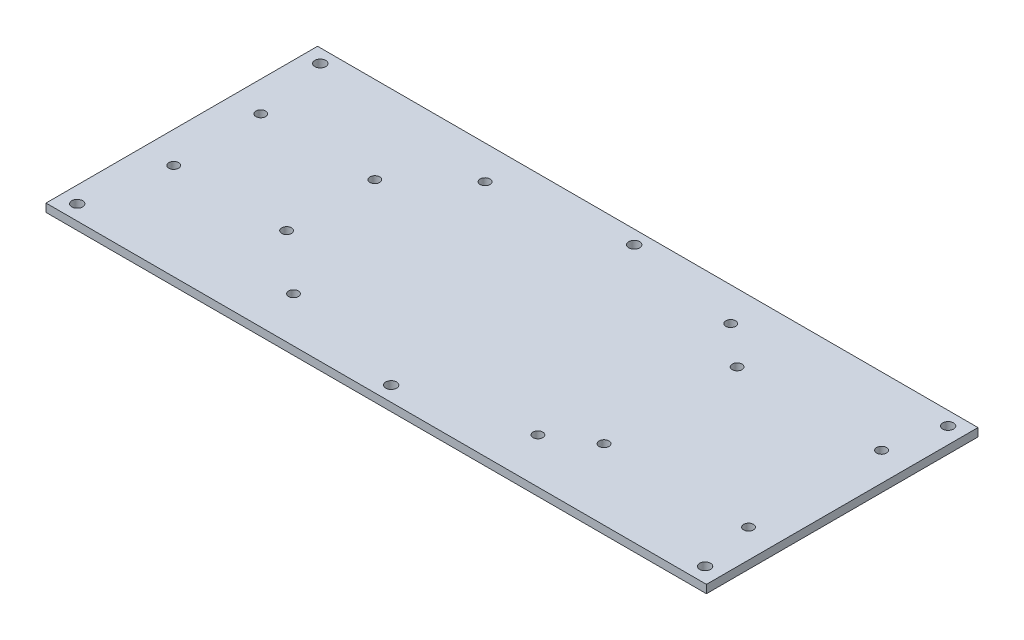
ISO-10303-21;
HEADER;
FILE_DESCRIPTION(('STEP AP214'),'2;1');
FILE_NAME('part.step','',(''),(''),'','','');
FILE_SCHEMA(('AUTOMOTIVE_DESIGN { 1 0 10303 214 1 1 1 1 }'));
ENDSEC;
DATA;
#1=APPLICATION_CONTEXT('core data for automotive mechanical design processes');
#2=APPLICATION_PROTOCOL_DEFINITION('international standard','automotive_design',2000,#1);
#3=PRODUCT_CONTEXT('',#1,'mechanical');
#4=PRODUCT('Part','Part','',(#3));
#5=PRODUCT_RELATED_PRODUCT_CATEGORY('part','',(#4));
#6=PRODUCT_DEFINITION_FORMATION('','',#4);
#7=PRODUCT_DEFINITION_CONTEXT('part definition',#1,'design');
#8=PRODUCT_DEFINITION('design','',#6,#7);
#9=PRODUCT_DEFINITION_SHAPE('','',#8);
#10=(LENGTH_UNIT() NAMED_UNIT(*) SI_UNIT(.MILLI.,.METRE.));
#11=(NAMED_UNIT(*) PLANE_ANGLE_UNIT() SI_UNIT($,.RADIAN.));
#12=(NAMED_UNIT(*) SI_UNIT($,.STERADIAN.) SOLID_ANGLE_UNIT());
#13=UNCERTAINTY_MEASURE_WITH_UNIT(LENGTH_MEASURE(1.E-05),#10,'distance_accuracy_value','');
#14=(GEOMETRIC_REPRESENTATION_CONTEXT(3) GLOBAL_UNCERTAINTY_ASSIGNED_CONTEXT((#13)) GLOBAL_UNIT_ASSIGNED_CONTEXT((#10,
#11,#12)) REPRESENTATION_CONTEXT('',''));
#15=CARTESIAN_POINT('',(0.,0.,0.));
#16=DIRECTION('',(0.,0.,1.));
#17=DIRECTION('',(1.,0.,0.));
#18=AXIS2_PLACEMENT_3D('',#15,#16,#17);
#19=CARTESIAN_POINT('',(0.,3.,0.));
#20=DIRECTION('',(0.,1.,0.));
#21=DIRECTION('',(0.,0.,1.));
#22=AXIS2_PLACEMENT_3D('',#19,#20,#21);
#23=PLANE('',#22);
#24=CARTESIAN_POINT('',(5.,3.,5.));
#25=DIRECTION('',(0.,1.,0.));
#26=DIRECTION('',(0.,0.,1.));
#27=AXIS2_PLACEMENT_3D('',#24,#25,#26);
#28=CIRCLE('',#27,2.);
#29=CARTESIAN_POINT('',(5.,3.,7.));
#30=VERTEX_POINT('',#29);
#31=EDGE_CURVE('E209',#30,#30,#28,.T.);
#32=ORIENTED_EDGE('',*,*,#31,.F.);
#33=EDGE_LOOP('',(#32));
#34=FACE_BOUND('',#33,.T.);
#35=CARTESIAN_POINT('',(178.495550597673,3.,25.));
#36=DIRECTION('',(0.,1.,0.));
#37=DIRECTION('',(0.,0.,1.));
#38=AXIS2_PLACEMENT_3D('',#35,#36,#37);
#39=CIRCLE('',#38,1.80000000000001);
#40=CARTESIAN_POINT('',(178.495550597673,3.,26.8));
#41=VERTEX_POINT('',#40);
#42=EDGE_CURVE('E197',#41,#41,#39,.T.);
#43=ORIENTED_EDGE('',*,*,#42,.F.);
#44=EDGE_LOOP('',(#43));
#45=FACE_BOUND('',#44,.T.);
#46=CARTESIAN_POINT('',(178.495550597673,3.,74.));
#47=DIRECTION('',(0.,1.,0.));
#48=DIRECTION('',(0.,0.,1.));
#49=AXIS2_PLACEMENT_3D('',#46,#47,#48);
#50=CIRCLE('',#49,1.80000000000001);
#51=CARTESIAN_POINT('',(178.495550597673,3.,75.8));
#52=VERTEX_POINT('',#51);
#53=EDGE_CURVE('E185',#52,#52,#50,.T.);
#54=ORIENTED_EDGE('',*,*,#53,.F.);
#55=EDGE_LOOP('',(#54));
#56=FACE_BOUND('',#55,.T.);
#57=CARTESIAN_POINT('',(231.695550597673,3.,25.));
#58=DIRECTION('',(0.,1.,0.));
#59=DIRECTION('',(0.,0.,1.));
#60=AXIS2_PLACEMENT_3D('',#57,#58,#59);
#61=CIRCLE('',#60,1.80000000000001);
#62=CARTESIAN_POINT('',(231.695550597673,3.,26.8));
#63=VERTEX_POINT('',#62);
#64=EDGE_CURVE('E173',#63,#63,#61,.T.);
#65=ORIENTED_EDGE('',*,*,#64,.F.);
#66=EDGE_LOOP('',(#65));
#67=FACE_BOUND('',#66,.T.);
#68=CARTESIAN_POINT('',(52.0911869267946,3.,32.));
#69=DIRECTION('',(0.,1.,0.));
#70=DIRECTION('',(0.,0.,1.));
#71=AXIS2_PLACEMENT_3D('',#68,#69,#70);
#72=CIRCLE('',#71,1.79999999999999);
#73=CARTESIAN_POINT('',(52.0911869267946,3.,33.8));
#74=VERTEX_POINT('',#73);
#75=EDGE_CURVE('E161',#74,#74,#72,.T.);
#76=ORIENTED_EDGE('',*,*,#75,.F.);
#77=EDGE_LOOP('',(#76));
#78=FACE_BOUND('',#77,.T.);
#79=CARTESIAN_POINT('',(10.0911869267946,3.,32.));
#80=DIRECTION('',(0.,1.,0.));
#81=DIRECTION('',(0.,0.,1.));
#82=AXIS2_PLACEMENT_3D('',#79,#80,#81);
#83=CIRCLE('',#82,1.80000000000001);
#84=CARTESIAN_POINT('',(10.0911869267946,3.,33.8));
#85=VERTEX_POINT('',#84);
#86=EDGE_CURVE('E149',#85,#85,#83,.T.);
#87=ORIENTED_EDGE('',*,*,#86,.F.);
#88=EDGE_LOOP('',(#87));
#89=FACE_BOUND('',#88,.T.);
#90=CARTESIAN_POINT('',(163.495550597673,3.,83.3605255005435));
#91=DIRECTION('',(0.,1.,0.));
#92=DIRECTION('',(0.,0.,1.));
#93=AXIS2_PLACEMENT_3D('',#90,#91,#92);
#94=CIRCLE('',#93,1.80000000000001);
#95=CARTESIAN_POINT('',(163.495550597673,3.,85.1605255005435));
#96=VERTEX_POINT('',#95);
#97=EDGE_CURVE('E137',#96,#96,#94,.T.);
#98=ORIENTED_EDGE('',*,*,#97,.F.);
#99=EDGE_LOOP('',(#98));
#100=FACE_BOUND('',#99,.T.);
#101=CARTESIAN_POINT('',(73.4955505976732,3.,83.3605255005436));
#102=DIRECTION('',(0.,1.,0.));
#103=DIRECTION('',(0.,0.,1.));
#104=AXIS2_PLACEMENT_3D('',#101,#102,#103);
#105=CIRCLE('',#104,1.79999999999999);
#106=CARTESIAN_POINT('',(73.4955505976732,3.,85.1605255005436));
#107=VERTEX_POINT('',#106);
#108=EDGE_CURVE('E125',#107,#107,#105,.T.);
#109=ORIENTED_EDGE('',*,*,#108,.F.);
#110=EDGE_LOOP('',(#109));
#111=FACE_BOUND('',#110,.T.);
#112=CARTESIAN_POINT('',(73.0495761534593,3.,12.3619261707321));
#113=DIRECTION('',(0.,1.,0.));
#114=DIRECTION('',(0.,0.,1.));
#115=AXIS2_PLACEMENT_3D('',#112,#113,#114);
#116=CIRCLE('',#115,1.79999999999999);
#117=CARTESIAN_POINT('',(73.0495761534593,3.,14.1619261707321));
#118=VERTEX_POINT('',#117);
#119=EDGE_CURVE('E104',#118,#118,#116,.T.);
#120=ORIENTED_EDGE('',*,*,#119,.F.);
#121=EDGE_LOOP('',(#120));
#122=FACE_BOUND('',#121,.T.);
#123=DIRECTION('',(0.,0.,1.));
#124=VECTOR('',#123,1.);
#125=CARTESIAN_POINT('',(-1.,3.,0.));
#126=LINE('',#125,#124);
#127=CARTESIAN_POINT('',(-1.,3.,0.));
#128=VERTEX_POINT('',#127);
#129=CARTESIAN_POINT('',(-1.,3.,100.));
#130=VERTEX_POINT('',#129);
#131=EDGE_CURVE('E89',#128,#130,#126,.T.);
#132=ORIENTED_EDGE('',*,*,#131,.T.);
#133=DIRECTION('',(1.,0.,0.));
#134=VECTOR('',#133,1.);
#135=CARTESIAN_POINT('',(-1.,3.,100.));
#136=LINE('',#135,#134);
#137=CARTESIAN_POINT('',(242.2,3.,100.));
#138=VERTEX_POINT('',#137);
#139=EDGE_CURVE('E84',#130,#138,#136,.T.);
#140=ORIENTED_EDGE('',*,*,#139,.T.);
#141=DIRECTION('',(0.,0.,-1.));
#142=VECTOR('',#141,1.);
#143=CARTESIAN_POINT('',(242.2,3.,0.));
#144=LINE('',#143,#142);
#145=CARTESIAN_POINT('',(242.2,3.,0.));
#146=VERTEX_POINT('',#145);
#147=EDGE_CURVE('E87',#138,#146,#144,.T.);
#148=ORIENTED_EDGE('',*,*,#147,.T.);
#149=DIRECTION('',(-1.,0.,0.));
#150=VECTOR('',#149,1.);
#151=CARTESIAN_POINT('',(-1.,3.,0.));
#152=LINE('',#151,#150);
#153=EDGE_CURVE('E54',#146,#128,#152,.T.);
#154=ORIENTED_EDGE('',*,*,#153,.T.);
#155=EDGE_LOOP('',(#132,#140,#148,#154));
#156=FACE_BOUND('',#155,.T.);
#157=CARTESIAN_POINT('',(236.2,3.,5.));
#158=DIRECTION('',(0.,1.,0.));
#159=DIRECTION('',(0.,0.,1.));
#160=AXIS2_PLACEMENT_3D('',#157,#158,#159);
#161=CIRCLE('',#160,2.);
#162=CARTESIAN_POINT('',(236.2,3.,7.));
#163=VERTEX_POINT('',#162);
#164=EDGE_CURVE('E119',#163,#163,#161,.T.);
#165=ORIENTED_EDGE('',*,*,#164,.F.);
#166=EDGE_LOOP('',(#165));
#167=FACE_BOUND('',#166,.T.);
#168=CARTESIAN_POINT('',(163.495550597673,3.,12.3605255005435));
#169=DIRECTION('',(0.,1.,0.));
#170=DIRECTION('',(0.,0.,1.));
#171=AXIS2_PLACEMENT_3D('',#168,#169,#170);
#172=CIRCLE('',#171,1.80000000000001);
#173=CARTESIAN_POINT('',(163.495550597673,3.,14.1605255005435));
#174=VERTEX_POINT('',#173);
#175=EDGE_CURVE('E131',#174,#174,#172,.T.);
#176=ORIENTED_EDGE('',*,*,#175,.F.);
#177=EDGE_LOOP('',(#176));
#178=FACE_BOUND('',#177,.T.);
#179=CARTESIAN_POINT('',(236.2,3.,94.5));
#180=DIRECTION('',(0.,1.,0.));
#181=DIRECTION('',(0.,0.,1.));
#182=AXIS2_PLACEMENT_3D('',#179,#180,#181);
#183=CIRCLE('',#182,2.);
#184=CARTESIAN_POINT('',(236.2,3.,96.5));
#185=VERTEX_POINT('',#184);
#186=EDGE_CURVE('E143',#185,#185,#183,.T.);
#187=ORIENTED_EDGE('',*,*,#186,.F.);
#188=EDGE_LOOP('',(#187));
#189=FACE_BOUND('',#188,.T.);
#190=CARTESIAN_POINT('',(10.5228834773099,3.,64.4971327671884));
#191=DIRECTION('',(0.,1.,0.));
#192=DIRECTION('',(0.,0.,1.));
#193=AXIS2_PLACEMENT_3D('',#190,#191,#192);
#194=CIRCLE('',#193,1.8);
#195=CARTESIAN_POINT('',(10.5228834773099,3.,66.2971327671885));
#196=VERTEX_POINT('',#195);
#197=EDGE_CURVE('E155',#196,#196,#194,.T.);
#198=ORIENTED_EDGE('',*,*,#197,.F.);
#199=EDGE_LOOP('',(#198));
#200=FACE_BOUND('',#199,.T.);
#201=CARTESIAN_POINT('',(52.0911869267946,3.,64.4971327671884));
#202=DIRECTION('',(0.,1.,0.));
#203=DIRECTION('',(0.,0.,1.));
#204=AXIS2_PLACEMENT_3D('',#201,#202,#203);
#205=CIRCLE('',#204,1.79999999999999);
#206=CARTESIAN_POINT('',(52.0911869267946,3.,66.2971327671884));
#207=VERTEX_POINT('',#206);
#208=EDGE_CURVE('E167',#207,#207,#205,.T.);
#209=ORIENTED_EDGE('',*,*,#208,.F.);
#210=EDGE_LOOP('',(#209));
#211=FACE_BOUND('',#210,.T.);
#212=CARTESIAN_POINT('',(231.695550597673,3.,74.));
#213=DIRECTION('',(0.,1.,0.));
#214=DIRECTION('',(0.,0.,1.));
#215=AXIS2_PLACEMENT_3D('',#212,#213,#214);
#216=CIRCLE('',#215,1.80000000000001);
#217=CARTESIAN_POINT('',(231.695550597673,3.,75.8));
#218=VERTEX_POINT('',#217);
#219=EDGE_CURVE('E179',#218,#218,#216,.T.);
#220=ORIENTED_EDGE('',*,*,#219,.F.);
#221=EDGE_LOOP('',(#220));
#222=FACE_BOUND('',#221,.T.);
#223=CARTESIAN_POINT('',(120.6,3.,5.00000000000001));
#224=DIRECTION('',(0.,1.,0.));
#225=DIRECTION('',(0.,0.,1.));
#226=AXIS2_PLACEMENT_3D('',#223,#224,#225);
#227=CIRCLE('',#226,2.);
#228=CARTESIAN_POINT('',(120.6,3.,7.));
#229=VERTEX_POINT('',#228);
#230=EDGE_CURVE('E191',#229,#229,#227,.T.);
#231=ORIENTED_EDGE('',*,*,#230,.F.);
#232=EDGE_LOOP('',(#231));
#233=FACE_BOUND('',#232,.T.);
#234=CARTESIAN_POINT('',(120.6,3.,94.5));
#235=DIRECTION('',(0.,1.,0.));
#236=DIRECTION('',(0.,0.,1.));
#237=AXIS2_PLACEMENT_3D('',#234,#235,#236);
#238=CIRCLE('',#237,2.);
#239=CARTESIAN_POINT('',(120.6,3.,96.5));
#240=VERTEX_POINT('',#239);
#241=EDGE_CURVE('E203',#240,#240,#238,.T.);
#242=ORIENTED_EDGE('',*,*,#241,.F.);
#243=EDGE_LOOP('',(#242));
#244=FACE_BOUND('',#243,.T.);
#245=CARTESIAN_POINT('',(4.99999999999999,3.,94.5));
#246=DIRECTION('',(0.,1.,0.));
#247=DIRECTION('',(0.,0.,1.));
#248=AXIS2_PLACEMENT_3D('',#245,#246,#247);
#249=CIRCLE('',#248,2.);
#250=CARTESIAN_POINT('',(4.99999999999999,3.,96.5));
#251=VERTEX_POINT('',#250);
#252=EDGE_CURVE('E215',#251,#251,#249,.T.);
#253=ORIENTED_EDGE('',*,*,#252,.F.);
#254=EDGE_LOOP('',(#253));
#255=FACE_BOUND('',#254,.T.);
#256=ADVANCED_FACE('F37',(#34,#45,#56,#67,#78,#89,#100,#111,#122,#156,#167,#178,#189,#200,#211,
#222,#233,#244,#255),#23,.T.);
#257=CARTESIAN_POINT('',(0.,0.,0.));
#258=DIRECTION('',(0.,1.,0.));
#259=DIRECTION('',(0.,0.,1.));
#260=AXIS2_PLACEMENT_3D('',#257,#258,#259);
#261=PLANE('',#260);
#262=DIRECTION('',(0.,0.,1.));
#263=VECTOR('',#262,1.);
#264=CARTESIAN_POINT('',(-1.,0.,0.));
#265=LINE('',#264,#263);
#266=CARTESIAN_POINT('',(-1.,0.,0.));
#267=VERTEX_POINT('',#266);
#268=CARTESIAN_POINT('',(-1.,0.,100.));
#269=VERTEX_POINT('',#268);
#270=EDGE_CURVE('E101',#267,#269,#265,.T.);
#271=ORIENTED_EDGE('',*,*,#270,.F.);
#272=DIRECTION('',(-1.,0.,0.));
#273=VECTOR('',#272,1.);
#274=CARTESIAN_POINT('',(-1.,0.,0.));
#275=LINE('',#274,#273);
#276=CARTESIAN_POINT('',(242.2,0.,0.));
#277=VERTEX_POINT('',#276);
#278=EDGE_CURVE('E77',#277,#267,#275,.T.);
#279=ORIENTED_EDGE('',*,*,#278,.F.);
#280=DIRECTION('',(0.,0.,-1.));
#281=VECTOR('',#280,1.);
#282=CARTESIAN_POINT('',(242.2,0.,0.));
#283=LINE('',#282,#281);
#284=CARTESIAN_POINT('',(242.2,0.,100.));
#285=VERTEX_POINT('',#284);
#286=EDGE_CURVE('E71',#285,#277,#283,.T.);
#287=ORIENTED_EDGE('',*,*,#286,.F.);
#288=DIRECTION('',(1.,0.,0.));
#289=VECTOR('',#288,1.);
#290=CARTESIAN_POINT('',(-1.,0.,100.));
#291=LINE('',#290,#289);
#292=EDGE_CURVE('E93',#269,#285,#291,.T.);
#293=ORIENTED_EDGE('',*,*,#292,.F.);
#294=EDGE_LOOP('',(#271,#279,#287,#293));
#295=FACE_BOUND('',#294,.T.);
#296=CARTESIAN_POINT('',(73.0495761534593,0.,12.3619261707321));
#297=DIRECTION('',(0.,1.,0.));
#298=DIRECTION('',(0.,0.,1.));
#299=AXIS2_PLACEMENT_3D('',#296,#297,#298);
#300=CIRCLE('',#299,1.79999999999999);
#301=CARTESIAN_POINT('',(73.0495761534593,0.,14.1619261707321));
#302=VERTEX_POINT('',#301);
#303=EDGE_CURVE('E116',#302,#302,#300,.T.);
#304=ORIENTED_EDGE('',*,*,#303,.T.);
#305=EDGE_LOOP('',(#304));
#306=FACE_BOUND('',#305,.T.);
#307=CARTESIAN_POINT('',(236.2,0.,5.));
#308=DIRECTION('',(0.,1.,0.));
#309=DIRECTION('',(0.,0.,1.));
#310=AXIS2_PLACEMENT_3D('',#307,#308,#309);
#311=CIRCLE('',#310,2.);
#312=CARTESIAN_POINT('',(236.2,0.,7.));
#313=VERTEX_POINT('',#312);
#314=EDGE_CURVE('E122',#313,#313,#311,.T.);
#315=ORIENTED_EDGE('',*,*,#314,.T.);
#316=EDGE_LOOP('',(#315));
#317=FACE_BOUND('',#316,.T.);
#318=CARTESIAN_POINT('',(73.4955505976732,0.,83.3605255005436));
#319=DIRECTION('',(0.,1.,0.));
#320=DIRECTION('',(0.,0.,1.));
#321=AXIS2_PLACEMENT_3D('',#318,#319,#320);
#322=CIRCLE('',#321,1.79999999999999);
#323=CARTESIAN_POINT('',(73.4955505976732,0.,85.1605255005436));
#324=VERTEX_POINT('',#323);
#325=EDGE_CURVE('E128',#324,#324,#322,.T.);
#326=ORIENTED_EDGE('',*,*,#325,.T.);
#327=EDGE_LOOP('',(#326));
#328=FACE_BOUND('',#327,.T.);
#329=CARTESIAN_POINT('',(163.495550597673,0.,12.3605255005435));
#330=DIRECTION('',(0.,1.,0.));
#331=DIRECTION('',(0.,0.,1.));
#332=AXIS2_PLACEMENT_3D('',#329,#330,#331);
#333=CIRCLE('',#332,1.80000000000001);
#334=CARTESIAN_POINT('',(163.495550597673,0.,14.1605255005435));
#335=VERTEX_POINT('',#334);
#336=EDGE_CURVE('E134',#335,#335,#333,.T.);
#337=ORIENTED_EDGE('',*,*,#336,.T.);
#338=EDGE_LOOP('',(#337));
#339=FACE_BOUND('',#338,.T.);
#340=CARTESIAN_POINT('',(163.495550597673,0.,83.3605255005435));
#341=DIRECTION('',(0.,1.,0.));
#342=DIRECTION('',(0.,0.,1.));
#343=AXIS2_PLACEMENT_3D('',#340,#341,#342);
#344=CIRCLE('',#343,1.80000000000001);
#345=CARTESIAN_POINT('',(163.495550597673,0.,85.1605255005435));
#346=VERTEX_POINT('',#345);
#347=EDGE_CURVE('E140',#346,#346,#344,.T.);
#348=ORIENTED_EDGE('',*,*,#347,.T.);
#349=EDGE_LOOP('',(#348));
#350=FACE_BOUND('',#349,.T.);
#351=CARTESIAN_POINT('',(236.2,0.,94.5));
#352=DIRECTION('',(0.,1.,0.));
#353=DIRECTION('',(0.,0.,1.));
#354=AXIS2_PLACEMENT_3D('',#351,#352,#353);
#355=CIRCLE('',#354,2.);
#356=CARTESIAN_POINT('',(236.2,0.,96.5));
#357=VERTEX_POINT('',#356);
#358=EDGE_CURVE('E146',#357,#357,#355,.T.);
#359=ORIENTED_EDGE('',*,*,#358,.T.);
#360=EDGE_LOOP('',(#359));
#361=FACE_BOUND('',#360,.T.);
#362=CARTESIAN_POINT('',(10.0911869267946,0.,32.));
#363=DIRECTION('',(0.,1.,0.));
#364=DIRECTION('',(0.,0.,1.));
#365=AXIS2_PLACEMENT_3D('',#362,#363,#364);
#366=CIRCLE('',#365,1.80000000000001);
#367=CARTESIAN_POINT('',(10.0911869267946,0.,33.8));
#368=VERTEX_POINT('',#367);
#369=EDGE_CURVE('E152',#368,#368,#366,.T.);
#370=ORIENTED_EDGE('',*,*,#369,.T.);
#371=EDGE_LOOP('',(#370));
#372=FACE_BOUND('',#371,.T.);
#373=CARTESIAN_POINT('',(10.5228834773099,0.,64.4971327671884));
#374=DIRECTION('',(0.,1.,0.));
#375=DIRECTION('',(0.,0.,1.));
#376=AXIS2_PLACEMENT_3D('',#373,#374,#375);
#377=CIRCLE('',#376,1.8);
#378=CARTESIAN_POINT('',(10.5228834773099,0.,66.2971327671885));
#379=VERTEX_POINT('',#378);
#380=EDGE_CURVE('E158',#379,#379,#377,.T.);
#381=ORIENTED_EDGE('',*,*,#380,.T.);
#382=EDGE_LOOP('',(#381));
#383=FACE_BOUND('',#382,.T.);
#384=CARTESIAN_POINT('',(52.0911869267946,0.,32.));
#385=DIRECTION('',(0.,1.,0.));
#386=DIRECTION('',(0.,0.,1.));
#387=AXIS2_PLACEMENT_3D('',#384,#385,#386);
#388=CIRCLE('',#387,1.79999999999999);
#389=CARTESIAN_POINT('',(52.0911869267946,0.,33.8));
#390=VERTEX_POINT('',#389);
#391=EDGE_CURVE('E164',#390,#390,#388,.T.);
#392=ORIENTED_EDGE('',*,*,#391,.T.);
#393=EDGE_LOOP('',(#392));
#394=FACE_BOUND('',#393,.T.);
#395=CARTESIAN_POINT('',(52.0911869267946,0.,64.4971327671884));
#396=DIRECTION('',(0.,1.,0.));
#397=DIRECTION('',(0.,0.,1.));
#398=AXIS2_PLACEMENT_3D('',#395,#396,#397);
#399=CIRCLE('',#398,1.79999999999999);
#400=CARTESIAN_POINT('',(52.0911869267946,0.,66.2971327671884));
#401=VERTEX_POINT('',#400);
#402=EDGE_CURVE('E170',#401,#401,#399,.T.);
#403=ORIENTED_EDGE('',*,*,#402,.T.);
#404=EDGE_LOOP('',(#403));
#405=FACE_BOUND('',#404,.T.);
#406=CARTESIAN_POINT('',(231.695550597673,0.,25.));
#407=DIRECTION('',(0.,1.,0.));
#408=DIRECTION('',(0.,0.,1.));
#409=AXIS2_PLACEMENT_3D('',#406,#407,#408);
#410=CIRCLE('',#409,1.80000000000001);
#411=CARTESIAN_POINT('',(231.695550597673,0.,26.8));
#412=VERTEX_POINT('',#411);
#413=EDGE_CURVE('E176',#412,#412,#410,.T.);
#414=ORIENTED_EDGE('',*,*,#413,.T.);
#415=EDGE_LOOP('',(#414));
#416=FACE_BOUND('',#415,.T.);
#417=CARTESIAN_POINT('',(231.695550597673,0.,74.));
#418=DIRECTION('',(0.,1.,0.));
#419=DIRECTION('',(0.,0.,1.));
#420=AXIS2_PLACEMENT_3D('',#417,#418,#419);
#421=CIRCLE('',#420,1.80000000000001);
#422=CARTESIAN_POINT('',(231.695550597673,0.,75.8));
#423=VERTEX_POINT('',#422);
#424=EDGE_CURVE('E182',#423,#423,#421,.T.);
#425=ORIENTED_EDGE('',*,*,#424,.T.);
#426=EDGE_LOOP('',(#425));
#427=FACE_BOUND('',#426,.T.);
#428=CARTESIAN_POINT('',(178.495550597673,0.,74.));
#429=DIRECTION('',(0.,1.,0.));
#430=DIRECTION('',(0.,0.,1.));
#431=AXIS2_PLACEMENT_3D('',#428,#429,#430);
#432=CIRCLE('',#431,1.80000000000001);
#433=CARTESIAN_POINT('',(178.495550597673,0.,75.8));
#434=VERTEX_POINT('',#433);
#435=EDGE_CURVE('E188',#434,#434,#432,.T.);
#436=ORIENTED_EDGE('',*,*,#435,.T.);
#437=EDGE_LOOP('',(#436));
#438=FACE_BOUND('',#437,.T.);
#439=CARTESIAN_POINT('',(120.6,0.,5.00000000000001));
#440=DIRECTION('',(0.,1.,0.));
#441=DIRECTION('',(0.,0.,1.));
#442=AXIS2_PLACEMENT_3D('',#439,#440,#441);
#443=CIRCLE('',#442,2.);
#444=CARTESIAN_POINT('',(120.6,0.,7.));
#445=VERTEX_POINT('',#444);
#446=EDGE_CURVE('E194',#445,#445,#443,.T.);
#447=ORIENTED_EDGE('',*,*,#446,.T.);
#448=EDGE_LOOP('',(#447));
#449=FACE_BOUND('',#448,.T.);
#450=CARTESIAN_POINT('',(178.495550597673,0.,25.));
#451=DIRECTION('',(0.,1.,0.));
#452=DIRECTION('',(0.,0.,1.));
#453=AXIS2_PLACEMENT_3D('',#450,#451,#452);
#454=CIRCLE('',#453,1.80000000000001);
#455=CARTESIAN_POINT('',(178.495550597673,0.,26.8));
#456=VERTEX_POINT('',#455);
#457=EDGE_CURVE('E200',#456,#456,#454,.T.);
#458=ORIENTED_EDGE('',*,*,#457,.T.);
#459=EDGE_LOOP('',(#458));
#460=FACE_BOUND('',#459,.T.);
#461=CARTESIAN_POINT('',(120.6,0.,94.5));
#462=DIRECTION('',(0.,1.,0.));
#463=DIRECTION('',(0.,0.,1.));
#464=AXIS2_PLACEMENT_3D('',#461,#462,#463);
#465=CIRCLE('',#464,2.);
#466=CARTESIAN_POINT('',(120.6,0.,96.5));
#467=VERTEX_POINT('',#466);
#468=EDGE_CURVE('E206',#467,#467,#465,.T.);
#469=ORIENTED_EDGE('',*,*,#468,.T.);
#470=EDGE_LOOP('',(#469));
#471=FACE_BOUND('',#470,.T.);
#472=CARTESIAN_POINT('',(5.,0.,5.));
#473=DIRECTION('',(0.,1.,0.));
#474=DIRECTION('',(0.,0.,1.));
#475=AXIS2_PLACEMENT_3D('',#472,#473,#474);
#476=CIRCLE('',#475,2.);
#477=CARTESIAN_POINT('',(5.,0.,7.));
#478=VERTEX_POINT('',#477);
#479=EDGE_CURVE('E212',#478,#478,#476,.T.);
#480=ORIENTED_EDGE('',*,*,#479,.T.);
#481=EDGE_LOOP('',(#480));
#482=FACE_BOUND('',#481,.T.);
#483=CARTESIAN_POINT('',(4.99999999999999,0.,94.5));
#484=DIRECTION('',(0.,1.,0.));
#485=DIRECTION('',(0.,0.,1.));
#486=AXIS2_PLACEMENT_3D('',#483,#484,#485);
#487=CIRCLE('',#486,2.);
#488=CARTESIAN_POINT('',(4.99999999999999,0.,96.5));
#489=VERTEX_POINT('',#488);
#490=EDGE_CURVE('E218',#489,#489,#487,.T.);
#491=ORIENTED_EDGE('',*,*,#490,.T.);
#492=EDGE_LOOP('',(#491));
#493=FACE_BOUND('',#492,.T.);
#494=ADVANCED_FACE('F112',(#295,#306,#317,#328,#339,#350,#361,#372,#383,#394,#405,#416,#427,
#438,#449,#460,#471,#482,#493),#261,.F.);
#495=CARTESIAN_POINT('',(-1.,3.,0.));
#496=DIRECTION('',(1.,0.,0.));
#497=DIRECTION('',(0.,0.,-1.));
#498=AXIS2_PLACEMENT_3D('',#495,#496,#497);
#499=PLANE('',#498);
#500=ORIENTED_EDGE('',*,*,#270,.T.);
#501=DIRECTION('',(0.,-1.,0.));
#502=VECTOR('',#501,1.);
#503=CARTESIAN_POINT('',(-1.,3.,100.));
#504=LINE('',#503,#502);
#505=EDGE_CURVE('E11',#130,#269,#504,.T.);
#506=ORIENTED_EDGE('',*,*,#505,.F.);
#507=ORIENTED_EDGE('',*,*,#131,.F.);
#508=DIRECTION('',(0.,-1.,0.));
#509=VECTOR('',#508,1.);
#510=CARTESIAN_POINT('',(-1.,3.,0.));
#511=LINE('',#510,#509);
#512=EDGE_CURVE('E97',#128,#267,#511,.T.);
#513=ORIENTED_EDGE('',*,*,#512,.T.);
#514=EDGE_LOOP('',(#500,#506,#507,#513));
#515=FACE_BOUND('',#514,.T.);
#516=ADVANCED_FACE('F39',(#515),#499,.F.);
#517=CARTESIAN_POINT('',(-1.,3.,100.));
#518=DIRECTION('',(0.,0.,-1.));
#519=DIRECTION('',(-1.,0.,0.));
#520=AXIS2_PLACEMENT_3D('',#517,#518,#519);
#521=PLANE('',#520);
#522=ORIENTED_EDGE('',*,*,#292,.T.);
#523=DIRECTION('',(0.,-1.,0.));
#524=VECTOR('',#523,1.);
#525=CARTESIAN_POINT('',(242.2,3.,100.));
#526=LINE('',#525,#524);
#527=EDGE_CURVE('E46',#138,#285,#526,.T.);
#528=ORIENTED_EDGE('',*,*,#527,.F.);
#529=ORIENTED_EDGE('',*,*,#139,.F.);
#530=ORIENTED_EDGE('',*,*,#505,.T.);
#531=EDGE_LOOP('',(#522,#528,#529,#530));
#532=FACE_BOUND('',#531,.T.);
#533=ADVANCED_FACE('F92',(#532),#521,.F.);
#534=CARTESIAN_POINT('',(242.2,3.,0.));
#535=DIRECTION('',(-1.,0.,0.));
#536=DIRECTION('',(0.,0.,1.));
#537=AXIS2_PLACEMENT_3D('',#534,#535,#536);
#538=PLANE('',#537);
#539=ORIENTED_EDGE('',*,*,#286,.T.);
#540=DIRECTION('',(0.,-1.,0.));
#541=VECTOR('',#540,1.);
#542=CARTESIAN_POINT('',(242.2,3.,0.));
#543=LINE('',#542,#541);
#544=EDGE_CURVE('E94',#146,#277,#543,.T.);
#545=ORIENTED_EDGE('',*,*,#544,.F.);
#546=ORIENTED_EDGE('',*,*,#147,.F.);
#547=ORIENTED_EDGE('',*,*,#527,.T.);
#548=EDGE_LOOP('',(#539,#545,#546,#547));
#549=FACE_BOUND('',#548,.T.);
#550=ADVANCED_FACE('F95',(#549),#538,.F.);
#551=CARTESIAN_POINT('',(-1.,3.,0.));
#552=DIRECTION('',(0.,0.,1.));
#553=DIRECTION('',(1.,0.,0.));
#554=AXIS2_PLACEMENT_3D('',#551,#552,#553);
#555=PLANE('',#554);
#556=ORIENTED_EDGE('',*,*,#278,.T.);
#557=ORIENTED_EDGE('',*,*,#512,.F.);
#558=ORIENTED_EDGE('',*,*,#153,.F.);
#559=ORIENTED_EDGE('',*,*,#544,.T.);
#560=EDGE_LOOP('',(#556,#557,#558,#559));
#561=FACE_BOUND('',#560,.T.);
#562=ADVANCED_FACE('F109',(#561),#555,.F.);
#563=CARTESIAN_POINT('',(73.0495761534593,3.,12.3619261707321));
#564=DIRECTION('',(0.,-1.,0.));
#565=DIRECTION('',(0.,0.,-1.));
#566=AXIS2_PLACEMENT_3D('',#563,#564,#565);
#567=CYLINDRICAL_SURFACE('',#566,1.79999999999999);
#568=ORIENTED_EDGE('',*,*,#119,.T.);
#569=EDGE_LOOP('',(#568));
#570=FACE_BOUND('',#569,.T.);
#571=ORIENTED_EDGE('',*,*,#303,.F.);
#572=EDGE_LOOP('',(#571));
#573=FACE_BOUND('',#572,.T.);
#574=ADVANCED_FACE('F237',(#570,#573),#567,.F.);
#575=CARTESIAN_POINT('',(236.2,3.,5.));
#576=DIRECTION('',(0.,-1.,0.));
#577=DIRECTION('',(0.,0.,-1.));
#578=AXIS2_PLACEMENT_3D('',#575,#576,#577);
#579=CYLINDRICAL_SURFACE('',#578,2.);
#580=ORIENTED_EDGE('',*,*,#164,.T.);
#581=EDGE_LOOP('',(#580));
#582=FACE_BOUND('',#581,.T.);
#583=ORIENTED_EDGE('',*,*,#314,.F.);
#584=EDGE_LOOP('',(#583));
#585=FACE_BOUND('',#584,.T.);
#586=ADVANCED_FACE('F283',(#582,#585),#579,.F.);
#587=CARTESIAN_POINT('',(73.4955505976732,3.,83.3605255005436));
#588=DIRECTION('',(0.,-1.,0.));
#589=DIRECTION('',(0.,0.,-1.));
#590=AXIS2_PLACEMENT_3D('',#587,#588,#589);
#591=CYLINDRICAL_SURFACE('',#590,1.79999999999999);
#592=ORIENTED_EDGE('',*,*,#108,.T.);
#593=EDGE_LOOP('',(#592));
#594=FACE_BOUND('',#593,.T.);
#595=ORIENTED_EDGE('',*,*,#325,.F.);
#596=EDGE_LOOP('',(#595));
#597=FACE_BOUND('',#596,.T.);
#598=ADVANCED_FACE('F291',(#594,#597),#591,.F.);
#599=CARTESIAN_POINT('',(163.495550597673,3.,12.3605255005435));
#600=DIRECTION('',(0.,-1.,0.));
#601=DIRECTION('',(0.,0.,-1.));
#602=AXIS2_PLACEMENT_3D('',#599,#600,#601);
#603=CYLINDRICAL_SURFACE('',#602,1.80000000000001);
#604=ORIENTED_EDGE('',*,*,#175,.T.);
#605=EDGE_LOOP('',(#604));
#606=FACE_BOUND('',#605,.T.);
#607=ORIENTED_EDGE('',*,*,#336,.F.);
#608=EDGE_LOOP('',(#607));
#609=FACE_BOUND('',#608,.T.);
#610=ADVANCED_FACE('F299',(#606,#609),#603,.F.);
#611=CARTESIAN_POINT('',(163.495550597673,3.,83.3605255005435));
#612=DIRECTION('',(0.,-1.,0.));
#613=DIRECTION('',(0.,0.,-1.));
#614=AXIS2_PLACEMENT_3D('',#611,#612,#613);
#615=CYLINDRICAL_SURFACE('',#614,1.80000000000001);
#616=ORIENTED_EDGE('',*,*,#97,.T.);
#617=EDGE_LOOP('',(#616));
#618=FACE_BOUND('',#617,.T.);
#619=ORIENTED_EDGE('',*,*,#347,.F.);
#620=EDGE_LOOP('',(#619));
#621=FACE_BOUND('',#620,.T.);
#622=ADVANCED_FACE('F308',(#618,#621),#615,.F.);
#623=CARTESIAN_POINT('',(236.2,3.,94.5));
#624=DIRECTION('',(0.,-1.,0.));
#625=DIRECTION('',(0.,0.,-1.));
#626=AXIS2_PLACEMENT_3D('',#623,#624,#625);
#627=CYLINDRICAL_SURFACE('',#626,2.);
#628=ORIENTED_EDGE('',*,*,#186,.T.);
#629=EDGE_LOOP('',(#628));
#630=FACE_BOUND('',#629,.T.);
#631=ORIENTED_EDGE('',*,*,#358,.F.);
#632=EDGE_LOOP('',(#631));
#633=FACE_BOUND('',#632,.T.);
#634=ADVANCED_FACE('F317',(#630,#633),#627,.F.);
#635=CARTESIAN_POINT('',(10.0911869267946,3.,32.));
#636=DIRECTION('',(0.,-1.,0.));
#637=DIRECTION('',(0.,0.,-1.));
#638=AXIS2_PLACEMENT_3D('',#635,#636,#637);
#639=CYLINDRICAL_SURFACE('',#638,1.80000000000001);
#640=ORIENTED_EDGE('',*,*,#86,.T.);
#641=EDGE_LOOP('',(#640));
#642=FACE_BOUND('',#641,.T.);
#643=ORIENTED_EDGE('',*,*,#369,.F.);
#644=EDGE_LOOP('',(#643));
#645=FACE_BOUND('',#644,.T.);
#646=ADVANCED_FACE('F326',(#642,#645),#639,.F.);
#647=CARTESIAN_POINT('',(10.5228834773099,3.,64.4971327671884));
#648=DIRECTION('',(0.,-1.,0.));
#649=DIRECTION('',(0.,0.,-1.));
#650=AXIS2_PLACEMENT_3D('',#647,#648,#649);
#651=CYLINDRICAL_SURFACE('',#650,1.8);
#652=ORIENTED_EDGE('',*,*,#197,.T.);
#653=EDGE_LOOP('',(#652));
#654=FACE_BOUND('',#653,.T.);
#655=ORIENTED_EDGE('',*,*,#380,.F.);
#656=EDGE_LOOP('',(#655));
#657=FACE_BOUND('',#656,.T.);
#658=ADVANCED_FACE('F335',(#654,#657),#651,.F.);
#659=CARTESIAN_POINT('',(52.0911869267946,3.,32.));
#660=DIRECTION('',(0.,-1.,0.));
#661=DIRECTION('',(0.,0.,-1.));
#662=AXIS2_PLACEMENT_3D('',#659,#660,#661);
#663=CYLINDRICAL_SURFACE('',#662,1.79999999999999);
#664=ORIENTED_EDGE('',*,*,#75,.T.);
#665=EDGE_LOOP('',(#664));
#666=FACE_BOUND('',#665,.T.);
#667=ORIENTED_EDGE('',*,*,#391,.F.);
#668=EDGE_LOOP('',(#667));
#669=FACE_BOUND('',#668,.T.);
#670=ADVANCED_FACE('F344',(#666,#669),#663,.F.);
#671=CARTESIAN_POINT('',(52.0911869267946,3.,64.4971327671884));
#672=DIRECTION('',(0.,-1.,0.));
#673=DIRECTION('',(0.,0.,-1.));
#674=AXIS2_PLACEMENT_3D('',#671,#672,#673);
#675=CYLINDRICAL_SURFACE('',#674,1.79999999999999);
#676=ORIENTED_EDGE('',*,*,#208,.T.);
#677=EDGE_LOOP('',(#676));
#678=FACE_BOUND('',#677,.T.);
#679=ORIENTED_EDGE('',*,*,#402,.F.);
#680=EDGE_LOOP('',(#679));
#681=FACE_BOUND('',#680,.T.);
#682=ADVANCED_FACE('F353',(#678,#681),#675,.F.);
#683=CARTESIAN_POINT('',(231.695550597673,3.,25.));
#684=DIRECTION('',(0.,-1.,0.));
#685=DIRECTION('',(0.,0.,-1.));
#686=AXIS2_PLACEMENT_3D('',#683,#684,#685);
#687=CYLINDRICAL_SURFACE('',#686,1.80000000000001);
#688=ORIENTED_EDGE('',*,*,#64,.T.);
#689=EDGE_LOOP('',(#688));
#690=FACE_BOUND('',#689,.T.);
#691=ORIENTED_EDGE('',*,*,#413,.F.);
#692=EDGE_LOOP('',(#691));
#693=FACE_BOUND('',#692,.T.);
#694=ADVANCED_FACE('F362',(#690,#693),#687,.F.);
#695=CARTESIAN_POINT('',(231.695550597673,3.,74.));
#696=DIRECTION('',(0.,-1.,0.));
#697=DIRECTION('',(0.,0.,-1.));
#698=AXIS2_PLACEMENT_3D('',#695,#696,#697);
#699=CYLINDRICAL_SURFACE('',#698,1.80000000000001);
#700=ORIENTED_EDGE('',*,*,#219,.T.);
#701=EDGE_LOOP('',(#700));
#702=FACE_BOUND('',#701,.T.);
#703=ORIENTED_EDGE('',*,*,#424,.F.);
#704=EDGE_LOOP('',(#703));
#705=FACE_BOUND('',#704,.T.);
#706=ADVANCED_FACE('F371',(#702,#705),#699,.F.);
#707=CARTESIAN_POINT('',(178.495550597673,3.,74.));
#708=DIRECTION('',(0.,-1.,0.));
#709=DIRECTION('',(0.,0.,-1.));
#710=AXIS2_PLACEMENT_3D('',#707,#708,#709);
#711=CYLINDRICAL_SURFACE('',#710,1.80000000000001);
#712=ORIENTED_EDGE('',*,*,#53,.T.);
#713=EDGE_LOOP('',(#712));
#714=FACE_BOUND('',#713,.T.);
#715=ORIENTED_EDGE('',*,*,#435,.F.);
#716=EDGE_LOOP('',(#715));
#717=FACE_BOUND('',#716,.T.);
#718=ADVANCED_FACE('F380',(#714,#717),#711,.F.);
#719=CARTESIAN_POINT('',(120.6,3.,5.00000000000001));
#720=DIRECTION('',(0.,-1.,0.));
#721=DIRECTION('',(0.,0.,-1.));
#722=AXIS2_PLACEMENT_3D('',#719,#720,#721);
#723=CYLINDRICAL_SURFACE('',#722,2.);
#724=ORIENTED_EDGE('',*,*,#230,.T.);
#725=EDGE_LOOP('',(#724));
#726=FACE_BOUND('',#725,.T.);
#727=ORIENTED_EDGE('',*,*,#446,.F.);
#728=EDGE_LOOP('',(#727));
#729=FACE_BOUND('',#728,.T.);
#730=ADVANCED_FACE('F389',(#726,#729),#723,.F.);
#731=CARTESIAN_POINT('',(178.495550597673,3.,25.));
#732=DIRECTION('',(0.,-1.,0.));
#733=DIRECTION('',(0.,0.,-1.));
#734=AXIS2_PLACEMENT_3D('',#731,#732,#733);
#735=CYLINDRICAL_SURFACE('',#734,1.80000000000001);
#736=ORIENTED_EDGE('',*,*,#42,.T.);
#737=EDGE_LOOP('',(#736));
#738=FACE_BOUND('',#737,.T.);
#739=ORIENTED_EDGE('',*,*,#457,.F.);
#740=EDGE_LOOP('',(#739));
#741=FACE_BOUND('',#740,.T.);
#742=ADVANCED_FACE('F398',(#738,#741),#735,.F.);
#743=CARTESIAN_POINT('',(120.6,3.,94.5));
#744=DIRECTION('',(0.,-1.,0.));
#745=DIRECTION('',(0.,0.,-1.));
#746=AXIS2_PLACEMENT_3D('',#743,#744,#745);
#747=CYLINDRICAL_SURFACE('',#746,2.);
#748=ORIENTED_EDGE('',*,*,#241,.T.);
#749=EDGE_LOOP('',(#748));
#750=FACE_BOUND('',#749,.T.);
#751=ORIENTED_EDGE('',*,*,#468,.F.);
#752=EDGE_LOOP('',(#751));
#753=FACE_BOUND('',#752,.T.);
#754=ADVANCED_FACE('F407',(#750,#753),#747,.F.);
#755=CARTESIAN_POINT('',(5.,3.,5.));
#756=DIRECTION('',(0.,-1.,0.));
#757=DIRECTION('',(0.,0.,-1.));
#758=AXIS2_PLACEMENT_3D('',#755,#756,#757);
#759=CYLINDRICAL_SURFACE('',#758,2.);
#760=ORIENTED_EDGE('',*,*,#31,.T.);
#761=EDGE_LOOP('',(#760));
#762=FACE_BOUND('',#761,.T.);
#763=ORIENTED_EDGE('',*,*,#479,.F.);
#764=EDGE_LOOP('',(#763));
#765=FACE_BOUND('',#764,.T.);
#766=ADVANCED_FACE('F416',(#762,#765),#759,.F.);
#767=CARTESIAN_POINT('',(4.99999999999999,3.,94.5));
#768=DIRECTION('',(0.,-1.,0.));
#769=DIRECTION('',(0.,0.,-1.));
#770=AXIS2_PLACEMENT_3D('',#767,#768,#769);
#771=CYLINDRICAL_SURFACE('',#770,2.);
#772=ORIENTED_EDGE('',*,*,#252,.T.);
#773=EDGE_LOOP('',(#772));
#774=FACE_BOUND('',#773,.T.);
#775=ORIENTED_EDGE('',*,*,#490,.F.);
#776=EDGE_LOOP('',(#775));
#777=FACE_BOUND('',#776,.T.);
#778=ADVANCED_FACE('F224',(#774,#777),#771,.F.);
#779=CLOSED_SHELL('',(#256,#494,#516,#533,#550,#562,#574,#586,#598,#610,#622,#634,#646,#658,
#670,#682,#694,#706,#718,#730,#742,#754,#766,#778));
#780=MANIFOLD_SOLID_BREP('B2',#779);
#781=ADVANCED_BREP_SHAPE_REPRESENTATION('',(#18,#780),#14);
#782=SHAPE_DEFINITION_REPRESENTATION(#9,#781);
ENDSEC;
END-ISO-10303-21;
